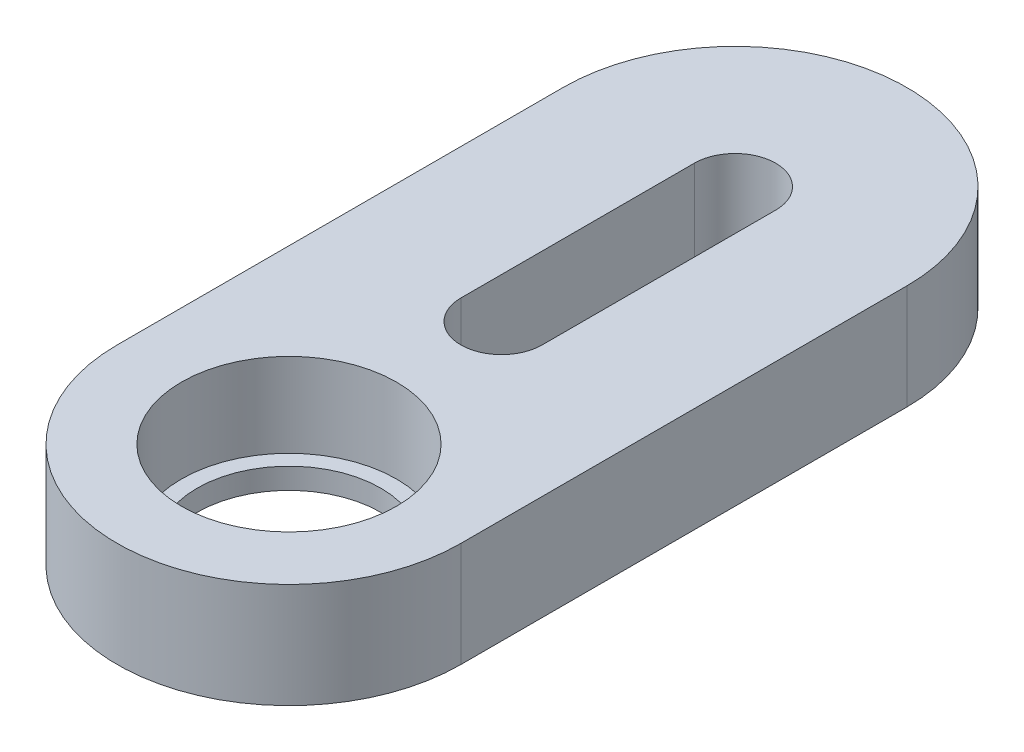
ISO-10303-21;
HEADER;
FILE_DESCRIPTION(('STEP AP214'),'2;1');
FILE_NAME('part.step','',(''),(''),'','','');
FILE_SCHEMA(('AUTOMOTIVE_DESIGN { 1 0 10303 214 1 1 1 1 }'));
ENDSEC;
DATA;
#1=APPLICATION_CONTEXT('core data for automotive mechanical design processes');
#2=APPLICATION_PROTOCOL_DEFINITION('international standard','automotive_design',2000,#1);
#3=PRODUCT_CONTEXT('',#1,'mechanical');
#4=PRODUCT('Part','Part','',(#3));
#5=PRODUCT_RELATED_PRODUCT_CATEGORY('part','',(#4));
#6=PRODUCT_DEFINITION_FORMATION('','',#4);
#7=PRODUCT_DEFINITION_CONTEXT('part definition',#1,'design');
#8=PRODUCT_DEFINITION('design','',#6,#7);
#9=PRODUCT_DEFINITION_SHAPE('','',#8);
#10=(LENGTH_UNIT() NAMED_UNIT(*) SI_UNIT(.MILLI.,.METRE.));
#11=(NAMED_UNIT(*) PLANE_ANGLE_UNIT() SI_UNIT($,.RADIAN.));
#12=(NAMED_UNIT(*) SI_UNIT($,.STERADIAN.) SOLID_ANGLE_UNIT());
#13=UNCERTAINTY_MEASURE_WITH_UNIT(LENGTH_MEASURE(1.E-05),#10,'distance_accuracy_value','');
#14=(GEOMETRIC_REPRESENTATION_CONTEXT(3) GLOBAL_UNCERTAINTY_ASSIGNED_CONTEXT((#13)) GLOBAL_UNIT_ASSIGNED_CONTEXT((#10,
#11,#12)) REPRESENTATION_CONTEXT('',''));
#15=CARTESIAN_POINT('',(0.,0.,0.));
#16=DIRECTION('',(0.,0.,1.));
#17=DIRECTION('',(1.,0.,0.));
#18=AXIS2_PLACEMENT_3D('',#15,#16,#17);
#19=CARTESIAN_POINT('',(0.,4.,0.));
#20=DIRECTION('',(0.,-1.,0.));
#21=DIRECTION('',(0.,0.,-1.));
#22=AXIS2_PLACEMENT_3D('',#19,#20,#21);
#23=CYLINDRICAL_SURFACE('',#22,6.55);
#24=CARTESIAN_POINT('',(0.,0.,0.));
#25=DIRECTION('',(0.,1.,0.));
#26=DIRECTION('',(0.,0.,1.));
#27=AXIS2_PLACEMENT_3D('',#24,#25,#26);
#28=CIRCLE('',#27,6.55);
#29=CARTESIAN_POINT('',(-6.55,0.,0.));
#30=VERTEX_POINT('',#29);
#31=CARTESIAN_POINT('',(6.55,0.,0.));
#32=VERTEX_POINT('',#31);
#33=EDGE_CURVE('E151',#30,#32,#28,.T.);
#34=ORIENTED_EDGE('',*,*,#33,.T.);
#35=DIRECTION('',(0.,-1.,0.));
#36=VECTOR('',#35,1.);
#37=CARTESIAN_POINT('',(6.55,4.,0.));
#38=LINE('',#37,#36);
#39=CARTESIAN_POINT('',(6.55,4.,0.));
#40=VERTEX_POINT('',#39);
#41=EDGE_CURVE('E46',#40,#32,#38,.T.);
#42=ORIENTED_EDGE('',*,*,#41,.F.);
#43=CARTESIAN_POINT('',(0.,4.,0.));
#44=DIRECTION('',(0.,1.,0.));
#45=DIRECTION('',(0.,0.,1.));
#46=AXIS2_PLACEMENT_3D('',#43,#44,#45);
#47=CIRCLE('',#46,6.55);
#48=CARTESIAN_POINT('',(-6.55,4.,0.));
#49=VERTEX_POINT('',#48);
#50=EDGE_CURVE('E125',#49,#40,#47,.T.);
#51=ORIENTED_EDGE('',*,*,#50,.F.);
#52=DIRECTION('',(0.,-1.,0.));
#53=VECTOR('',#52,1.);
#54=CARTESIAN_POINT('',(-6.55,4.,0.));
#55=LINE('',#54,#53);
#56=EDGE_CURVE('E54',#49,#30,#55,.T.);
#57=ORIENTED_EDGE('',*,*,#56,.T.);
#58=EDGE_LOOP('',(#34,#42,#51,#57));
#59=FACE_BOUND('',#58,.T.);
#60=ADVANCED_FACE('F37',(#59),#23,.T.);
#61=CARTESIAN_POINT('',(6.55,4.,0.));
#62=DIRECTION('',(1.,0.,0.));
#63=DIRECTION('',(0.,0.,-1.));
#64=AXIS2_PLACEMENT_3D('',#61,#62,#63);
#65=PLANE('',#64);
#66=DIRECTION('',(0.,0.,1.));
#67=VECTOR('',#66,1.);
#68=CARTESIAN_POINT('',(6.55,0.,0.));
#69=LINE('',#68,#67);
#70=CARTESIAN_POINT('',(6.55,0.,-17.));
#71=VERTEX_POINT('',#70);
#72=EDGE_CURVE('E114',#71,#32,#69,.T.);
#73=ORIENTED_EDGE('',*,*,#72,.F.);
#74=DIRECTION('',(0.,-1.,0.));
#75=VECTOR('',#74,1.);
#76=CARTESIAN_POINT('',(6.55,4.,-17.));
#77=LINE('',#76,#75);
#78=CARTESIAN_POINT('',(6.55,4.,-17.));
#79=VERTEX_POINT('',#78);
#80=EDGE_CURVE('E109',#79,#71,#77,.T.);
#81=ORIENTED_EDGE('',*,*,#80,.F.);
#82=DIRECTION('',(0.,0.,1.));
#83=VECTOR('',#82,1.);
#84=CARTESIAN_POINT('',(6.55,4.,0.));
#85=LINE('',#84,#83);
#86=EDGE_CURVE('E112',#79,#40,#85,.T.);
#87=ORIENTED_EDGE('',*,*,#86,.T.);
#88=ORIENTED_EDGE('',*,*,#41,.T.);
#89=EDGE_LOOP('',(#73,#81,#87,#88));
#90=FACE_BOUND('',#89,.T.);
#91=ADVANCED_FACE('F111',(#90),#65,.T.);
#92=CARTESIAN_POINT('',(0.,4.,-17.));
#93=DIRECTION('',(0.,-1.,0.));
#94=DIRECTION('',(0.,0.,-1.));
#95=AXIS2_PLACEMENT_3D('',#92,#93,#94);
#96=CYLINDRICAL_SURFACE('',#95,6.55);
#97=CARTESIAN_POINT('',(0.,0.,-17.));
#98=DIRECTION('',(0.,1.,0.));
#99=DIRECTION('',(0.,0.,1.));
#100=AXIS2_PLACEMENT_3D('',#97,#98,#99);
#101=CIRCLE('',#100,6.55);
#102=CARTESIAN_POINT('',(-6.55,0.,-17.));
#103=VERTEX_POINT('',#102);
#104=EDGE_CURVE('E154',#103,#71,#101,.F.);
#105=ORIENTED_EDGE('',*,*,#104,.F.);
#106=DIRECTION('',(0.,-1.,0.));
#107=VECTOR('',#106,1.);
#108=CARTESIAN_POINT('',(-6.55,4.,-17.));
#109=LINE('',#108,#107);
#110=CARTESIAN_POINT('',(-6.55,4.,-17.));
#111=VERTEX_POINT('',#110);
#112=EDGE_CURVE('E80',#111,#103,#109,.T.);
#113=ORIENTED_EDGE('',*,*,#112,.F.);
#114=CARTESIAN_POINT('',(0.,4.,-17.));
#115=DIRECTION('',(0.,1.,0.));
#116=DIRECTION('',(0.,0.,1.));
#117=AXIS2_PLACEMENT_3D('',#114,#115,#116);
#118=CIRCLE('',#117,6.55);
#119=EDGE_CURVE('E124',#111,#79,#118,.F.);
#120=ORIENTED_EDGE('',*,*,#119,.T.);
#121=ORIENTED_EDGE('',*,*,#80,.T.);
#122=EDGE_LOOP('',(#105,#113,#120,#121));
#123=FACE_BOUND('',#122,.T.);
#124=ADVANCED_FACE('F128',(#123),#96,.T.);
#125=CARTESIAN_POINT('',(0.,4.,-8.1));
#126=DIRECTION('',(0.,-1.,0.));
#127=DIRECTION('',(0.,0.,-1.));
#128=AXIS2_PLACEMENT_3D('',#125,#126,#127);
#129=CYLINDRICAL_SURFACE('',#128,1.55);
#130=CARTESIAN_POINT('',(0.,0.,-8.1));
#131=DIRECTION('',(0.,1.,0.));
#132=DIRECTION('',(0.,0.,1.));
#133=AXIS2_PLACEMENT_3D('',#130,#131,#132);
#134=CIRCLE('',#133,1.55);
#135=CARTESIAN_POINT('',(-1.55,0.,-8.1));
#136=VERTEX_POINT('',#135);
#137=CARTESIAN_POINT('',(1.55,0.,-8.1));
#138=VERTEX_POINT('',#137);
#139=EDGE_CURVE('E138',#136,#138,#134,.T.);
#140=ORIENTED_EDGE('',*,*,#139,.F.);
#141=DIRECTION('',(0.,-1.,0.));
#142=VECTOR('',#141,1.);
#143=CARTESIAN_POINT('',(-1.55,4.,-8.1));
#144=LINE('',#143,#142);
#145=CARTESIAN_POINT('',(-1.55,4.,-8.1));
#146=VERTEX_POINT('',#145);
#147=EDGE_CURVE('E92',#146,#136,#144,.T.);
#148=ORIENTED_EDGE('',*,*,#147,.F.);
#149=CARTESIAN_POINT('',(0.,4.,-8.1));
#150=DIRECTION('',(0.,1.,0.));
#151=DIRECTION('',(0.,0.,1.));
#152=AXIS2_PLACEMENT_3D('',#149,#150,#151);
#153=CIRCLE('',#152,1.55);
#154=CARTESIAN_POINT('',(1.55,4.,-8.1));
#155=VERTEX_POINT('',#154);
#156=EDGE_CURVE('E159',#146,#155,#153,.T.);
#157=ORIENTED_EDGE('',*,*,#156,.T.);
#158=DIRECTION('',(0.,-1.,0.));
#159=VECTOR('',#158,1.);
#160=CARTESIAN_POINT('',(1.55,4.,-8.1));
#161=LINE('',#160,#159);
#162=EDGE_CURVE('E137',#155,#138,#161,.T.);
#163=ORIENTED_EDGE('',*,*,#162,.T.);
#164=EDGE_LOOP('',(#140,#148,#157,#163));
#165=FACE_BOUND('',#164,.T.);
#166=ADVANCED_FACE('F39',(#165),#129,.F.);
#167=CARTESIAN_POINT('',(-1.55,4.,0.));
#168=DIRECTION('',(1.,0.,0.));
#169=DIRECTION('',(0.,0.,-1.));
#170=AXIS2_PLACEMENT_3D('',#167,#168,#169);
#171=PLANE('',#170);
#172=DIRECTION('',(0.,0.,1.));
#173=VECTOR('',#172,1.);
#174=CARTESIAN_POINT('',(-1.55,0.,0.));
#175=LINE('',#174,#173);
#176=CARTESIAN_POINT('',(-1.55,0.,-17.));
#177=VERTEX_POINT('',#176);
#178=EDGE_CURVE('E141',#177,#136,#175,.T.);
#179=ORIENTED_EDGE('',*,*,#178,.F.);
#180=DIRECTION('',(0.,-1.,0.));
#181=VECTOR('',#180,1.);
#182=CARTESIAN_POINT('',(-1.55,4.,-17.));
#183=LINE('',#182,#181);
#184=CARTESIAN_POINT('',(-1.55,4.,-17.));
#185=VERTEX_POINT('',#184);
#186=EDGE_CURVE('E166',#185,#177,#183,.T.);
#187=ORIENTED_EDGE('',*,*,#186,.F.);
#188=DIRECTION('',(0.,0.,1.));
#189=VECTOR('',#188,1.);
#190=CARTESIAN_POINT('',(-1.55,4.,0.));
#191=LINE('',#190,#189);
#192=EDGE_CURVE('E172',#185,#146,#191,.T.);
#193=ORIENTED_EDGE('',*,*,#192,.T.);
#194=ORIENTED_EDGE('',*,*,#147,.T.);
#195=EDGE_LOOP('',(#179,#187,#193,#194));
#196=FACE_BOUND('',#195,.T.);
#197=ADVANCED_FACE('F170',(#196),#171,.T.);
#198=CARTESIAN_POINT('',(0.,4.,-17.));
#199=DIRECTION('',(0.,-1.,0.));
#200=DIRECTION('',(0.,0.,-1.));
#201=AXIS2_PLACEMENT_3D('',#198,#199,#200);
#202=CYLINDRICAL_SURFACE('',#201,1.55);
#203=CARTESIAN_POINT('',(0.,0.,-17.));
#204=DIRECTION('',(0.,1.,0.));
#205=DIRECTION('',(0.,0.,1.));
#206=AXIS2_PLACEMENT_3D('',#203,#204,#205);
#207=CIRCLE('',#206,1.55);
#208=CARTESIAN_POINT('',(1.55,0.,-17.));
#209=VERTEX_POINT('',#208);
#210=EDGE_CURVE('E145',#209,#177,#207,.T.);
#211=ORIENTED_EDGE('',*,*,#210,.F.);
#212=DIRECTION('',(0.,-1.,0.));
#213=VECTOR('',#212,1.);
#214=CARTESIAN_POINT('',(1.55,4.,-17.));
#215=LINE('',#214,#213);
#216=CARTESIAN_POINT('',(1.55,4.,-17.));
#217=VERTEX_POINT('',#216);
#218=EDGE_CURVE('E164',#217,#209,#215,.T.);
#219=ORIENTED_EDGE('',*,*,#218,.F.);
#220=CARTESIAN_POINT('',(0.,4.,-17.));
#221=DIRECTION('',(0.,1.,0.));
#222=DIRECTION('',(0.,0.,1.));
#223=AXIS2_PLACEMENT_3D('',#220,#221,#222);
#224=CIRCLE('',#223,1.55);
#225=EDGE_CURVE('E184',#217,#185,#224,.T.);
#226=ORIENTED_EDGE('',*,*,#225,.T.);
#227=ORIENTED_EDGE('',*,*,#186,.T.);
#228=EDGE_LOOP('',(#211,#219,#226,#227));
#229=FACE_BOUND('',#228,.T.);
#230=ADVANCED_FACE('F180',(#229),#202,.F.);
#231=CARTESIAN_POINT('',(-6.55,4.,0.));
#232=DIRECTION('',(-1.,0.,0.));
#233=DIRECTION('',(0.,0.,1.));
#234=AXIS2_PLACEMENT_3D('',#231,#232,#233);
#235=PLANE('',#234);
#236=DIRECTION('',(0.,0.,-1.));
#237=VECTOR('',#236,1.);
#238=CARTESIAN_POINT('',(-6.55,0.,0.));
#239=LINE('',#238,#237);
#240=EDGE_CURVE('E156',#30,#103,#239,.T.);
#241=ORIENTED_EDGE('',*,*,#240,.F.);
#242=ORIENTED_EDGE('',*,*,#56,.F.);
#243=DIRECTION('',(0.,0.,-1.));
#244=VECTOR('',#243,1.);
#245=CARTESIAN_POINT('',(-6.55,4.,0.));
#246=LINE('',#245,#244);
#247=EDGE_CURVE('E129',#49,#111,#246,.T.);
#248=ORIENTED_EDGE('',*,*,#247,.T.);
#249=ORIENTED_EDGE('',*,*,#112,.T.);
#250=EDGE_LOOP('',(#241,#242,#248,#249));
#251=FACE_BOUND('',#250,.T.);
#252=ADVANCED_FACE('F196',(#251),#235,.T.);
#253=CARTESIAN_POINT('',(1.55,4.,0.));
#254=DIRECTION('',(1.,0.,0.));
#255=DIRECTION('',(0.,0.,-1.));
#256=AXIS2_PLACEMENT_3D('',#253,#254,#255);
#257=PLANE('',#256);
#258=DIRECTION('',(0.,0.,1.));
#259=VECTOR('',#258,1.);
#260=CARTESIAN_POINT('',(1.55,0.,0.));
#261=LINE('',#260,#259);
#262=EDGE_CURVE('E148',#209,#138,#261,.T.);
#263=ORIENTED_EDGE('',*,*,#262,.T.);
#264=ORIENTED_EDGE('',*,*,#162,.F.);
#265=DIRECTION('',(0.,0.,1.));
#266=VECTOR('',#265,1.);
#267=CARTESIAN_POINT('',(1.55,4.,0.));
#268=LINE('',#267,#266);
#269=EDGE_CURVE('E187',#217,#155,#268,.T.);
#270=ORIENTED_EDGE('',*,*,#269,.F.);
#271=ORIENTED_EDGE('',*,*,#218,.T.);
#272=EDGE_LOOP('',(#263,#264,#270,#271));
#273=FACE_BOUND('',#272,.T.);
#274=ADVANCED_FACE('F193',(#273),#257,.F.);
#275=CARTESIAN_POINT('',(0.,4.,0.));
#276=DIRECTION('',(0.,-1.,0.));
#277=DIRECTION('',(0.,0.,-1.));
#278=AXIS2_PLACEMENT_3D('',#275,#276,#277);
#279=CYLINDRICAL_SURFACE('',#278,4.1);
#280=CARTESIAN_POINT('',(0.,0.8,0.));
#281=DIRECTION('',(0.,1.,0.));
#282=DIRECTION('',(0.,0.,1.));
#283=AXIS2_PLACEMENT_3D('',#280,#281,#282);
#284=CIRCLE('',#283,4.1);
#285=CARTESIAN_POINT('',(0.,0.8,4.1));
#286=VERTEX_POINT('',#285);
#287=EDGE_CURVE('E11',#286,#286,#284,.T.);
#288=ORIENTED_EDGE('',*,*,#287,.F.);
#289=EDGE_LOOP('',(#288));
#290=FACE_BOUND('',#289,.T.);
#291=CARTESIAN_POINT('',(0.,4.,0.));
#292=DIRECTION('',(0.,1.,0.));
#293=DIRECTION('',(0.,0.,1.));
#294=AXIS2_PLACEMENT_3D('',#291,#292,#293);
#295=CIRCLE('',#294,4.1);
#296=CARTESIAN_POINT('',(0.,4.,4.1));
#297=VERTEX_POINT('',#296);
#298=EDGE_CURVE('E131',#297,#297,#295,.T.);
#299=ORIENTED_EDGE('',*,*,#298,.T.);
#300=EDGE_LOOP('',(#299));
#301=FACE_BOUND('',#300,.T.);
#302=ADVANCED_FACE('F195',(#290,#301),#279,.F.);
#303=CARTESIAN_POINT('',(0.,4.,0.));
#304=DIRECTION('',(0.,1.,0.));
#305=DIRECTION('',(0.,0.,1.));
#306=AXIS2_PLACEMENT_3D('',#303,#304,#305);
#307=PLANE('',#306);
#308=ORIENTED_EDGE('',*,*,#156,.F.);
#309=ORIENTED_EDGE('',*,*,#192,.F.);
#310=ORIENTED_EDGE('',*,*,#225,.F.);
#311=ORIENTED_EDGE('',*,*,#269,.T.);
#312=EDGE_LOOP('',(#308,#309,#310,#311));
#313=FACE_BOUND('',#312,.T.);
#314=ORIENTED_EDGE('',*,*,#50,.T.);
#315=ORIENTED_EDGE('',*,*,#86,.F.);
#316=ORIENTED_EDGE('',*,*,#119,.F.);
#317=ORIENTED_EDGE('',*,*,#247,.F.);
#318=EDGE_LOOP('',(#314,#315,#316,#317));
#319=FACE_BOUND('',#318,.T.);
#320=ORIENTED_EDGE('',*,*,#298,.F.);
#321=EDGE_LOOP('',(#320));
#322=FACE_BOUND('',#321,.T.);
#323=ADVANCED_FACE('F121',(#313,#319,#322),#307,.T.);
#324=CARTESIAN_POINT('',(0.,0.,0.));
#325=DIRECTION('',(0.,1.,0.));
#326=DIRECTION('',(0.,0.,1.));
#327=AXIS2_PLACEMENT_3D('',#324,#325,#326);
#328=PLANE('',#327);
#329=CARTESIAN_POINT('',(0.,0.,0.));
#330=DIRECTION('',(0.,1.,0.));
#331=DIRECTION('',(0.,0.,1.));
#332=AXIS2_PLACEMENT_3D('',#329,#330,#331);
#333=CIRCLE('',#332,3.5);
#334=CARTESIAN_POINT('',(0.,0.,3.5));
#335=VERTEX_POINT('',#334);
#336=EDGE_CURVE('E142',#335,#335,#333,.T.);
#337=ORIENTED_EDGE('',*,*,#336,.T.);
#338=EDGE_LOOP('',(#337));
#339=FACE_BOUND('',#338,.T.);
#340=ORIENTED_EDGE('',*,*,#139,.T.);
#341=ORIENTED_EDGE('',*,*,#262,.F.);
#342=ORIENTED_EDGE('',*,*,#210,.T.);
#343=ORIENTED_EDGE('',*,*,#178,.T.);
#344=EDGE_LOOP('',(#340,#341,#342,#343));
#345=FACE_BOUND('',#344,.T.);
#346=ORIENTED_EDGE('',*,*,#33,.F.);
#347=ORIENTED_EDGE('',*,*,#240,.T.);
#348=ORIENTED_EDGE('',*,*,#104,.T.);
#349=ORIENTED_EDGE('',*,*,#72,.T.);
#350=EDGE_LOOP('',(#346,#347,#348,#349));
#351=FACE_BOUND('',#350,.T.);
#352=ADVANCED_FACE('F176',(#339,#345,#351),#328,.F.);
#353=CARTESIAN_POINT('',(0.,0.8,0.));
#354=DIRECTION('',(0.,1.,0.));
#355=DIRECTION('',(0.,0.,1.));
#356=AXIS2_PLACEMENT_3D('',#353,#354,#355);
#357=PLANE('',#356);
#358=CARTESIAN_POINT('',(0.,0.8,0.));
#359=DIRECTION('',(0.,1.,0.));
#360=DIRECTION('',(0.,0.,1.));
#361=AXIS2_PLACEMENT_3D('',#358,#359,#360);
#362=CIRCLE('',#361,3.5);
#363=CARTESIAN_POINT('',(0.,0.8,3.5));
#364=VERTEX_POINT('',#363);
#365=EDGE_CURVE('E234',#364,#364,#362,.T.);
#366=ORIENTED_EDGE('',*,*,#365,.F.);
#367=EDGE_LOOP('',(#366));
#368=FACE_BOUND('',#367,.T.);
#369=ORIENTED_EDGE('',*,*,#287,.T.);
#370=EDGE_LOOP('',(#369));
#371=FACE_BOUND('',#370,.T.);
#372=ADVANCED_FACE('F217',(#368,#371),#357,.T.);
#373=CARTESIAN_POINT('',(0.,0.,0.));
#374=DIRECTION('',(0.,1.,0.));
#375=DIRECTION('',(0.,0.,1.));
#376=AXIS2_PLACEMENT_3D('',#373,#374,#375);
#377=CYLINDRICAL_SURFACE('',#376,3.5);
#378=ORIENTED_EDGE('',*,*,#336,.F.);
#379=EDGE_LOOP('',(#378));
#380=FACE_BOUND('',#379,.T.);
#381=ORIENTED_EDGE('',*,*,#365,.T.);
#382=EDGE_LOOP('',(#381));
#383=FACE_BOUND('',#382,.T.);
#384=ADVANCED_FACE('F223',(#380,#383),#377,.F.);
#385=CLOSED_SHELL('',(#60,#91,#124,#166,#197,#230,#252,#274,#302,#323,#352,#372,#384));
#386=MANIFOLD_SOLID_BREP('B2',#385);
#387=ADVANCED_BREP_SHAPE_REPRESENTATION('',(#18,#386),#14);
#388=SHAPE_DEFINITION_REPRESENTATION(#9,#387);
ENDSEC;
END-ISO-10303-21;
